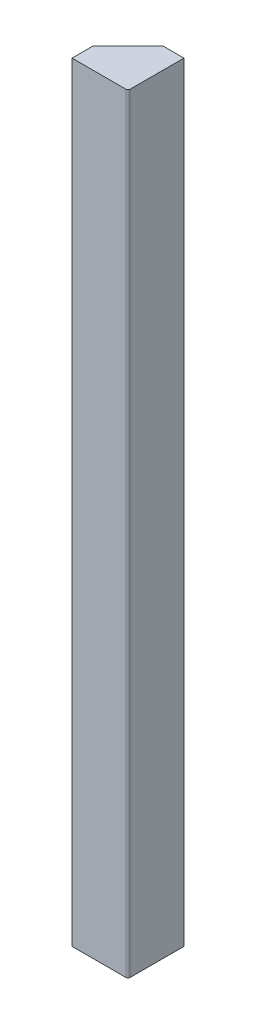
ISO-10303-21;
HEADER;
FILE_DESCRIPTION(('STEP AP214'),'2;1');
FILE_NAME('part.step','',(''),(''),'','','');
FILE_SCHEMA(('AUTOMOTIVE_DESIGN { 1 0 10303 214 1 1 1 1 }'));
ENDSEC;
DATA;
#1=APPLICATION_CONTEXT('core data for automotive mechanical design processes');
#2=APPLICATION_PROTOCOL_DEFINITION('international standard','automotive_design',2000,#1);
#3=PRODUCT_CONTEXT('',#1,'mechanical');
#4=PRODUCT('Part','Part','',(#3));
#5=PRODUCT_RELATED_PRODUCT_CATEGORY('part','',(#4));
#6=PRODUCT_DEFINITION_FORMATION('','',#4);
#7=PRODUCT_DEFINITION_CONTEXT('part definition',#1,'design');
#8=PRODUCT_DEFINITION('design','',#6,#7);
#9=PRODUCT_DEFINITION_SHAPE('','',#8);
#10=(LENGTH_UNIT() NAMED_UNIT(*) SI_UNIT(.MILLI.,.METRE.));
#11=(NAMED_UNIT(*) PLANE_ANGLE_UNIT() SI_UNIT($,.RADIAN.));
#12=(NAMED_UNIT(*) SI_UNIT($,.STERADIAN.) SOLID_ANGLE_UNIT());
#13=UNCERTAINTY_MEASURE_WITH_UNIT(LENGTH_MEASURE(1.E-05),#10,'distance_accuracy_value','');
#14=(GEOMETRIC_REPRESENTATION_CONTEXT(3) GLOBAL_UNCERTAINTY_ASSIGNED_CONTEXT((#13)) GLOBAL_UNIT_ASSIGNED_CONTEXT((#10,
#11,#12)) REPRESENTATION_CONTEXT('',''));
#15=CARTESIAN_POINT('',(0.,0.,0.));
#16=DIRECTION('',(0.,0.,1.));
#17=DIRECTION('',(1.,0.,0.));
#18=AXIS2_PLACEMENT_3D('',#15,#16,#17);
#19=CARTESIAN_POINT('',(0.,1100.,80.));
#20=DIRECTION('',(1.,0.,0.));
#21=DIRECTION('',(0.,0.,-1.));
#22=AXIS2_PLACEMENT_3D('',#19,#20,#21);
#23=PLANE('',#22);
#24=DIRECTION('',(0.,0.,1.));
#25=VECTOR('',#24,1.);
#26=CARTESIAN_POINT('',(0.,0.,80.));
#27=LINE('',#26,#25);
#28=CARTESIAN_POINT('',(0.,0.,50.));
#29=VERTEX_POINT('',#28);
#30=CARTESIAN_POINT('',(0.,0.,80.));
#31=VERTEX_POINT('',#30);
#32=EDGE_CURVE('E79',#29,#31,#27,.T.);
#33=ORIENTED_EDGE('',*,*,#32,.T.);
#34=DIRECTION('',(0.,-1.,0.));
#35=VECTOR('',#34,1.);
#36=CARTESIAN_POINT('',(0.,1100.,80.));
#37=LINE('',#36,#35);
#38=CARTESIAN_POINT('',(0.,1100.,80.));
#39=VERTEX_POINT('',#38);
#40=EDGE_CURVE('E83',#39,#31,#37,.T.);
#41=ORIENTED_EDGE('',*,*,#40,.F.);
#42=DIRECTION('',(0.,0.,1.));
#43=VECTOR('',#42,1.);
#44=CARTESIAN_POINT('',(0.,1100.,80.));
#45=LINE('',#44,#43);
#46=CARTESIAN_POINT('',(0.,1100.,50.));
#47=VERTEX_POINT('',#46);
#48=EDGE_CURVE('E102',#47,#39,#45,.T.);
#49=ORIENTED_EDGE('',*,*,#48,.F.);
#50=DIRECTION('',(0.,-1.,0.));
#51=VECTOR('',#50,1.);
#52=CARTESIAN_POINT('',(0.,1100.,50.));
#53=LINE('',#52,#51);
#54=EDGE_CURVE('E94',#47,#29,#53,.T.);
#55=ORIENTED_EDGE('',*,*,#54,.T.);
#56=EDGE_LOOP('',(#33,#41,#49,#55));
#57=FACE_BOUND('',#56,.T.);
#58=ADVANCED_FACE('F26',(#57),#23,.F.);
#59=CARTESIAN_POINT('',(0.,1100.,80.));
#60=DIRECTION('',(0.,0.,-1.));
#61=DIRECTION('',(-1.,0.,0.));
#62=AXIS2_PLACEMENT_3D('',#59,#60,#61);
#63=PLANE('',#62);
#64=DIRECTION('',(1.,0.,0.));
#65=VECTOR('',#64,1.);
#66=CARTESIAN_POINT('',(0.,0.,80.));
#67=LINE('',#66,#65);
#68=CARTESIAN_POINT('',(77.,0.,80.));
#69=VERTEX_POINT('',#68);
#70=EDGE_CURVE('E74',#31,#69,#67,.T.);
#71=ORIENTED_EDGE('',*,*,#70,.T.);
#72=DIRECTION('',(0.,-1.,0.));
#73=VECTOR('',#72,1.);
#74=CARTESIAN_POINT('',(77.,1100.,80.));
#75=LINE('',#74,#73);
#76=CARTESIAN_POINT('',(77.,1100.,80.));
#77=VERTEX_POINT('',#76);
#78=EDGE_CURVE('E33',#69,#77,#75,.F.);
#79=ORIENTED_EDGE('',*,*,#78,.T.);
#80=DIRECTION('',(1.,0.,0.));
#81=VECTOR('',#80,1.);
#82=CARTESIAN_POINT('',(0.,1100.,80.));
#83=LINE('',#82,#81);
#84=EDGE_CURVE('E85',#39,#77,#83,.T.);
#85=ORIENTED_EDGE('',*,*,#84,.F.);
#86=ORIENTED_EDGE('',*,*,#40,.T.);
#87=EDGE_LOOP('',(#71,#79,#85,#86));
#88=FACE_BOUND('',#87,.T.);
#89=ADVANCED_FACE('F84',(#88),#63,.F.);
#90=CARTESIAN_POINT('',(80.,1100.,0.));
#91=DIRECTION('',(-1.,0.,0.));
#92=DIRECTION('',(0.,0.,1.));
#93=AXIS2_PLACEMENT_3D('',#90,#91,#92);
#94=PLANE('',#93);
#95=DIRECTION('',(0.,0.,-1.));
#96=VECTOR('',#95,1.);
#97=CARTESIAN_POINT('',(80.,1100.,0.));
#98=LINE('',#97,#96);
#99=CARTESIAN_POINT('',(80.,1100.,77.));
#100=VERTEX_POINT('',#99);
#101=CARTESIAN_POINT('',(80.,1100.,0.));
#102=VERTEX_POINT('',#101);
#103=EDGE_CURVE('E105',#100,#102,#98,.T.);
#104=ORIENTED_EDGE('',*,*,#103,.F.);
#105=DIRECTION('',(0.,-1.,0.));
#106=VECTOR('',#105,1.);
#107=CARTESIAN_POINT('',(80.,1100.,77.));
#108=LINE('',#107,#106);
#109=CARTESIAN_POINT('',(80.,0.,77.));
#110=VERTEX_POINT('',#109);
#111=EDGE_CURVE('E89',#100,#110,#108,.T.);
#112=ORIENTED_EDGE('',*,*,#111,.T.);
#113=DIRECTION('',(0.,0.,-1.));
#114=VECTOR('',#113,1.);
#115=CARTESIAN_POINT('',(80.,0.,0.));
#116=LINE('',#115,#114);
#117=CARTESIAN_POINT('',(80.,0.,0.));
#118=VERTEX_POINT('',#117);
#119=EDGE_CURVE('E80',#110,#118,#116,.T.);
#120=ORIENTED_EDGE('',*,*,#119,.T.);
#121=DIRECTION('',(0.,-1.,0.));
#122=VECTOR('',#121,1.);
#123=CARTESIAN_POINT('',(80.,1100.,0.));
#124=LINE('',#123,#122);
#125=EDGE_CURVE('E90',#102,#118,#124,.T.);
#126=ORIENTED_EDGE('',*,*,#125,.F.);
#127=EDGE_LOOP('',(#104,#112,#120,#126));
#128=FACE_BOUND('',#127,.T.);
#129=ADVANCED_FACE('F122',(#128),#94,.F.);
#130=CARTESIAN_POINT('',(50.,1100.,0.));
#131=DIRECTION('',(0.,0.,1.));
#132=DIRECTION('',(1.,0.,0.));
#133=AXIS2_PLACEMENT_3D('',#130,#131,#132);
#134=PLANE('',#133);
#135=DIRECTION('',(-1.,0.,0.));
#136=VECTOR('',#135,1.);
#137=CARTESIAN_POINT('',(50.,0.,0.));
#138=LINE('',#137,#136);
#139=CARTESIAN_POINT('',(50.,0.,0.));
#140=VERTEX_POINT('',#139);
#141=EDGE_CURVE('E98',#118,#140,#138,.T.);
#142=ORIENTED_EDGE('',*,*,#141,.T.);
#143=DIRECTION('',(0.,-1.,0.));
#144=VECTOR('',#143,1.);
#145=CARTESIAN_POINT('',(50.,1100.,0.));
#146=LINE('',#145,#144);
#147=CARTESIAN_POINT('',(50.,1100.,0.));
#148=VERTEX_POINT('',#147);
#149=EDGE_CURVE('E112',#148,#140,#146,.T.);
#150=ORIENTED_EDGE('',*,*,#149,.F.);
#151=DIRECTION('',(-1.,0.,0.));
#152=VECTOR('',#151,1.);
#153=CARTESIAN_POINT('',(50.,1100.,0.));
#154=LINE('',#153,#152);
#155=EDGE_CURVE('E107',#102,#148,#154,.T.);
#156=ORIENTED_EDGE('',*,*,#155,.F.);
#157=ORIENTED_EDGE('',*,*,#125,.T.);
#158=EDGE_LOOP('',(#142,#150,#156,#157));
#159=FACE_BOUND('',#158,.T.);
#160=ADVANCED_FACE('F129',(#159),#134,.F.);
#161=CARTESIAN_POINT('',(0.,1100.,50.));
#162=DIRECTION('',(0.707106781186548,0.,0.707106781186548));
#163=DIRECTION('',(0.707106781186548,0.,-0.707106781186548));
#164=AXIS2_PLACEMENT_3D('',#161,#162,#163);
#165=PLANE('',#164);
#166=DIRECTION('',(-0.707106781186547,0.,0.707106781186547));
#167=VECTOR('',#166,1.);
#168=CARTESIAN_POINT('',(0.,0.,50.));
#169=LINE('',#168,#167);
#170=EDGE_CURVE('E100',#140,#29,#169,.T.);
#171=ORIENTED_EDGE('',*,*,#170,.T.);
#172=ORIENTED_EDGE('',*,*,#54,.F.);
#173=DIRECTION('',(-0.707106781186547,0.,0.707106781186547));
#174=VECTOR('',#173,1.);
#175=CARTESIAN_POINT('',(0.,1100.,50.));
#176=LINE('',#175,#174);
#177=EDGE_CURVE('E109',#148,#47,#176,.T.);
#178=ORIENTED_EDGE('',*,*,#177,.F.);
#179=ORIENTED_EDGE('',*,*,#149,.T.);
#180=EDGE_LOOP('',(#171,#172,#178,#179));
#181=FACE_BOUND('',#180,.T.);
#182=ADVANCED_FACE('F133',(#181),#165,.F.);
#183=CARTESIAN_POINT('',(0.,1100.,0.));
#184=DIRECTION('',(0.,-1.,0.));
#185=DIRECTION('',(0.,0.,-1.));
#186=AXIS2_PLACEMENT_3D('',#183,#184,#185);
#187=PLANE('',#186);
#188=ORIENTED_EDGE('',*,*,#84,.T.);
#189=CARTESIAN_POINT('',(77.,1100.,77.));
#190=DIRECTION('',(0.,-1.,0.));
#191=DIRECTION('',(0.,0.,-1.));
#192=AXIS2_PLACEMENT_3D('',#189,#190,#191);
#193=CIRCLE('',#192,3.);
#194=EDGE_CURVE('E11',#77,#100,#193,.F.);
#195=ORIENTED_EDGE('',*,*,#194,.T.);
#196=ORIENTED_EDGE('',*,*,#103,.T.);
#197=ORIENTED_EDGE('',*,*,#155,.T.);
#198=ORIENTED_EDGE('',*,*,#177,.T.);
#199=ORIENTED_EDGE('',*,*,#48,.T.);
#200=EDGE_LOOP('',(#188,#195,#196,#197,#198,#199));
#201=FACE_BOUND('',#200,.T.);
#202=ADVANCED_FACE('F135',(#201),#187,.F.);
#203=CARTESIAN_POINT('',(0.,0.,0.));
#204=DIRECTION('',(0.,-1.,0.));
#205=DIRECTION('',(0.,0.,-1.));
#206=AXIS2_PLACEMENT_3D('',#203,#204,#205);
#207=PLANE('',#206);
#208=ORIENTED_EDGE('',*,*,#119,.F.);
#209=CARTESIAN_POINT('',(77.,0.,77.));
#210=DIRECTION('',(0.,-1.,0.));
#211=DIRECTION('',(0.,0.,-1.));
#212=AXIS2_PLACEMENT_3D('',#209,#210,#211);
#213=CIRCLE('',#212,3.);
#214=EDGE_CURVE('E47',#110,#69,#213,.T.);
#215=ORIENTED_EDGE('',*,*,#214,.T.);
#216=ORIENTED_EDGE('',*,*,#70,.F.);
#217=ORIENTED_EDGE('',*,*,#32,.F.);
#218=ORIENTED_EDGE('',*,*,#170,.F.);
#219=ORIENTED_EDGE('',*,*,#141,.F.);
#220=EDGE_LOOP('',(#208,#215,#216,#217,#218,#219));
#221=FACE_BOUND('',#220,.T.);
#222=ADVANCED_FACE('F76',(#221),#207,.T.);
#223=CARTESIAN_POINT('',(77.,1100.,77.));
#224=DIRECTION('',(0.,-1.,0.));
#225=DIRECTION('',(0.,0.,-1.));
#226=AXIS2_PLACEMENT_3D('',#223,#224,#225);
#227=CYLINDRICAL_SURFACE('',#226,3.);
#228=ORIENTED_EDGE('',*,*,#194,.F.);
#229=ORIENTED_EDGE('',*,*,#78,.F.);
#230=ORIENTED_EDGE('',*,*,#214,.F.);
#231=ORIENTED_EDGE('',*,*,#111,.F.);
#232=EDGE_LOOP('',(#228,#229,#230,#231));
#233=FACE_BOUND('',#232,.T.);
#234=ADVANCED_FACE('F136',(#233),#227,.T.);
#235=CLOSED_SHELL('',(#58,#89,#129,#160,#182,#202,#222,#234));
#236=MANIFOLD_SOLID_BREP('B2',#235);
#237=ADVANCED_BREP_SHAPE_REPRESENTATION('',(#18,#236),#14);
#238=SHAPE_DEFINITION_REPRESENTATION(#9,#237);
ENDSEC;
END-ISO-10303-21;
